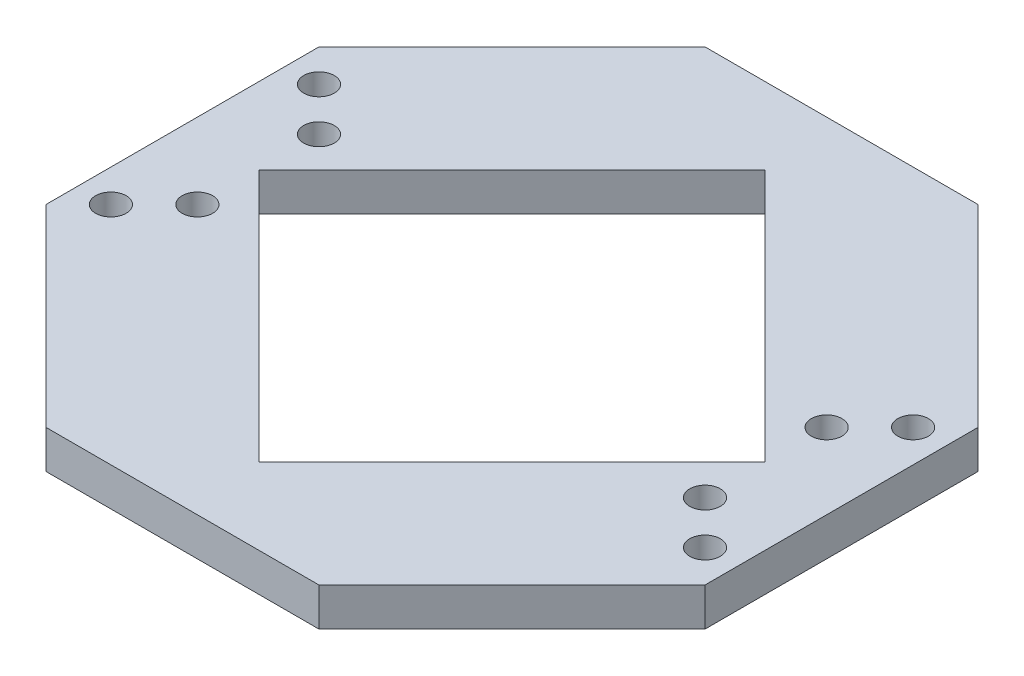
ISO-10303-21;
HEADER;
FILE_DESCRIPTION(('STEP AP214'),'2;1');
FILE_NAME('part.step','',(''),(''),'','','');
FILE_SCHEMA(('AUTOMOTIVE_DESIGN { 1 0 10303 214 1 1 1 1 }'));
ENDSEC;
DATA;
#1=APPLICATION_CONTEXT('core data for automotive mechanical design processes');
#2=APPLICATION_PROTOCOL_DEFINITION('international standard','automotive_design',2000,#1);
#3=PRODUCT_CONTEXT('',#1,'mechanical');
#4=PRODUCT('Part','Part','',(#3));
#5=PRODUCT_RELATED_PRODUCT_CATEGORY('part','',(#4));
#6=PRODUCT_DEFINITION_FORMATION('','',#4);
#7=PRODUCT_DEFINITION_CONTEXT('part definition',#1,'design');
#8=PRODUCT_DEFINITION('design','',#6,#7);
#9=PRODUCT_DEFINITION_SHAPE('','',#8);
#10=(LENGTH_UNIT() NAMED_UNIT(*) SI_UNIT(.MILLI.,.METRE.));
#11=(NAMED_UNIT(*) PLANE_ANGLE_UNIT() SI_UNIT($,.RADIAN.));
#12=(NAMED_UNIT(*) SI_UNIT($,.STERADIAN.) SOLID_ANGLE_UNIT());
#13=UNCERTAINTY_MEASURE_WITH_UNIT(LENGTH_MEASURE(1.E-05),#10,'distance_accuracy_value','');
#14=(GEOMETRIC_REPRESENTATION_CONTEXT(3) GLOBAL_UNCERTAINTY_ASSIGNED_CONTEXT((#13)) GLOBAL_UNIT_ASSIGNED_CONTEXT((#10,
#11,#12)) REPRESENTATION_CONTEXT('',''));
#15=CARTESIAN_POINT('',(0.,0.,0.));
#16=DIRECTION('',(0.,0.,1.));
#17=DIRECTION('',(1.,0.,0.));
#18=AXIS2_PLACEMENT_3D('',#15,#16,#17);
#19=CARTESIAN_POINT('',(38.7054579625169,6.35,-38.7054579625174));
#20=DIRECTION('',(-0.707106781186542,0.,0.707106781186553));
#21=DIRECTION('',(0.707106781186553,0.,0.707106781186542));
#22=AXIS2_PLACEMENT_3D('',#19,#20,#21);
#23=PLANE('',#22);
#24=DIRECTION('',(-0.707106781186553,0.,-0.707106781186542));
#25=VECTOR('',#24,1.);
#26=CARTESIAN_POINT('',(38.7054579625169,0.,-38.7054579625174));
#27=LINE('',#26,#25);
#28=CARTESIAN_POINT('',(54.7377835884533,0.,-22.6731323365812));
#29=VERTEX_POINT('',#28);
#30=CARTESIAN_POINT('',(22.6731323365804,0.,-54.7377835884536));
#31=VERTEX_POINT('',#30);
#32=EDGE_CURVE('E172',#29,#31,#27,.T.);
#33=ORIENTED_EDGE('',*,*,#32,.T.);
#34=DIRECTION('',(0.,-1.,0.));
#35=VECTOR('',#34,1.);
#36=CARTESIAN_POINT('',(22.6731323365804,6.35,-54.7377835884536));
#37=LINE('',#36,#35);
#38=CARTESIAN_POINT('',(22.6731323365804,6.35,-54.7377835884536));
#39=VERTEX_POINT('',#38);
#40=EDGE_CURVE('E11',#39,#31,#37,.T.);
#41=ORIENTED_EDGE('',*,*,#40,.F.);
#42=DIRECTION('',(-0.707106781186553,0.,-0.707106781186542));
#43=VECTOR('',#42,1.);
#44=CARTESIAN_POINT('',(38.7054579625169,6.35,-38.7054579625174));
#45=LINE('',#44,#43);
#46=CARTESIAN_POINT('',(54.7377835884533,6.35,-22.6731323365812));
#47=VERTEX_POINT('',#46);
#48=EDGE_CURVE('E225',#47,#39,#45,.T.);
#49=ORIENTED_EDGE('',*,*,#48,.F.);
#50=DIRECTION('',(0.,-1.,0.));
#51=VECTOR('',#50,1.);
#52=CARTESIAN_POINT('',(54.7377835884533,6.35,-22.6731323365812));
#53=LINE('',#52,#51);
#54=EDGE_CURVE('E187',#47,#29,#53,.T.);
#55=ORIENTED_EDGE('',*,*,#54,.T.);
#56=EDGE_LOOP('',(#33,#41,#49,#55));
#57=FACE_BOUND('',#56,.T.);
#58=ADVANCED_FACE('F35',(#57),#23,.F.);
#59=CARTESIAN_POINT('',(-4.18799294267021E-13,6.35,-54.7377835884535));
#60=DIRECTION('',(0.,0.,1.));
#61=DIRECTION('',(1.,0.,0.));
#62=AXIS2_PLACEMENT_3D('',#59,#60,#61);
#63=PLANE('',#62);
#64=DIRECTION('',(-1.,0.,0.));
#65=VECTOR('',#64,1.);
#66=CARTESIAN_POINT('',(-4.18799294267021E-13,0.,-54.7377835884535));
#67=LINE('',#66,#65);
#68=CARTESIAN_POINT('',(-22.6731323365813,0.,-54.7377835884533));
#69=VERTEX_POINT('',#68);
#70=EDGE_CURVE('E175',#31,#69,#67,.T.);
#71=ORIENTED_EDGE('',*,*,#70,.T.);
#72=DIRECTION('',(0.,-1.,0.));
#73=VECTOR('',#72,1.);
#74=CARTESIAN_POINT('',(-22.6731323365813,6.35,-54.7377835884533));
#75=LINE('',#74,#73);
#76=CARTESIAN_POINT('',(-22.6731323365813,6.35,-54.7377835884533));
#77=VERTEX_POINT('',#76);
#78=EDGE_CURVE('E45',#77,#69,#75,.T.);
#79=ORIENTED_EDGE('',*,*,#78,.F.);
#80=DIRECTION('',(-1.,0.,0.));
#81=VECTOR('',#80,1.);
#82=CARTESIAN_POINT('',(-4.18799294267021E-13,6.35,-54.7377835884535));
#83=LINE('',#82,#81);
#84=EDGE_CURVE('E227',#39,#77,#83,.T.);
#85=ORIENTED_EDGE('',*,*,#84,.F.);
#86=ORIENTED_EDGE('',*,*,#40,.T.);
#87=EDGE_LOOP('',(#71,#79,#85,#86));
#88=FACE_BOUND('',#87,.T.);
#89=ADVANCED_FACE('F263',(#88),#63,.F.);
#90=CARTESIAN_POINT('',(-38.7054579625174,6.35,-38.7054579625169));
#91=DIRECTION('',(0.707106781186553,0.,0.707106781186542));
#92=DIRECTION('',(0.707106781186542,0.,-0.707106781186553));
#93=AXIS2_PLACEMENT_3D('',#90,#91,#92);
#94=PLANE('',#93);
#95=DIRECTION('',(-0.707106781186542,0.,0.707106781186553));
#96=VECTOR('',#95,1.);
#97=CARTESIAN_POINT('',(-38.7054579625174,0.,-38.7054579625169));
#98=LINE('',#97,#96);
#99=CARTESIAN_POINT('',(-54.7377835884536,0.,-22.6731323365804));
#100=VERTEX_POINT('',#99);
#101=EDGE_CURVE('E177',#69,#100,#98,.T.);
#102=ORIENTED_EDGE('',*,*,#101,.T.);
#103=DIRECTION('',(0.,-1.,0.));
#104=VECTOR('',#103,1.);
#105=CARTESIAN_POINT('',(-54.7377835884536,6.35,-22.6731323365804));
#106=LINE('',#105,#104);
#107=CARTESIAN_POINT('',(-54.7377835884536,6.35,-22.6731323365804));
#108=VERTEX_POINT('',#107);
#109=EDGE_CURVE('E194',#108,#100,#106,.T.);
#110=ORIENTED_EDGE('',*,*,#109,.F.);
#111=DIRECTION('',(-0.707106781186542,0.,0.707106781186553));
#112=VECTOR('',#111,1.);
#113=CARTESIAN_POINT('',(-38.7054579625174,6.35,-38.7054579625169));
#114=LINE('',#113,#112);
#115=EDGE_CURVE('E232',#77,#108,#114,.T.);
#116=ORIENTED_EDGE('',*,*,#115,.F.);
#117=ORIENTED_EDGE('',*,*,#78,.T.);
#118=EDGE_LOOP('',(#102,#110,#116,#117));
#119=FACE_BOUND('',#118,.T.);
#120=ADVANCED_FACE('F268',(#119),#94,.F.);
#121=CARTESIAN_POINT('',(-54.7377835884535,6.35,4.1042330838168E-13));
#122=DIRECTION('',(1.,0.,0.));
#123=DIRECTION('',(0.,0.,-1.));
#124=AXIS2_PLACEMENT_3D('',#121,#122,#123);
#125=PLANE('',#124);
#126=DIRECTION('',(0.,0.,1.));
#127=VECTOR('',#126,1.);
#128=CARTESIAN_POINT('',(-54.7377835884535,0.,4.1042330838168E-13));
#129=LINE('',#128,#127);
#130=CARTESIAN_POINT('',(-54.7377835884533,0.,22.6731323365813));
#131=VERTEX_POINT('',#130);
#132=EDGE_CURVE('E179',#100,#131,#129,.T.);
#133=ORIENTED_EDGE('',*,*,#132,.T.);
#134=DIRECTION('',(0.,-1.,0.));
#135=VECTOR('',#134,1.);
#136=CARTESIAN_POINT('',(-54.7377835884533,6.35,22.6731323365813));
#137=LINE('',#136,#135);
#138=CARTESIAN_POINT('',(-54.7377835884533,6.35,22.6731323365813));
#139=VERTEX_POINT('',#138);
#140=EDGE_CURVE('E191',#139,#131,#137,.T.);
#141=ORIENTED_EDGE('',*,*,#140,.F.);
#142=DIRECTION('',(0.,0.,1.));
#143=VECTOR('',#142,1.);
#144=CARTESIAN_POINT('',(-54.7377835884535,6.35,4.1042330838168E-13));
#145=LINE('',#144,#143);
#146=EDGE_CURVE('E234',#108,#139,#145,.T.);
#147=ORIENTED_EDGE('',*,*,#146,.F.);
#148=ORIENTED_EDGE('',*,*,#109,.T.);
#149=EDGE_LOOP('',(#133,#141,#147,#148));
#150=FACE_BOUND('',#149,.T.);
#151=ADVANCED_FACE('F240',(#150),#125,.F.);
#152=CARTESIAN_POINT('',(-38.7054579625169,6.35,38.7054579625175));
#153=DIRECTION('',(0.707106781186542,0.,-0.707106781186553));
#154=DIRECTION('',(-0.707106781186553,0.,-0.707106781186542));
#155=AXIS2_PLACEMENT_3D('',#152,#153,#154);
#156=PLANE('',#155);
#157=DIRECTION('',(0.707106781186553,0.,0.707106781186542));
#158=VECTOR('',#157,1.);
#159=CARTESIAN_POINT('',(-38.7054579625169,0.,38.7054579625175));
#160=LINE('',#159,#158);
#161=CARTESIAN_POINT('',(-22.6731323365805,0.,54.7377835884536));
#162=VERTEX_POINT('',#161);
#163=EDGE_CURVE('E181',#131,#162,#160,.T.);
#164=ORIENTED_EDGE('',*,*,#163,.T.);
#165=DIRECTION('',(0.,-1.,0.));
#166=VECTOR('',#165,1.);
#167=CARTESIAN_POINT('',(-22.6731323365805,6.35,54.7377835884536));
#168=LINE('',#167,#166);
#169=CARTESIAN_POINT('',(-22.6731323365805,6.35,54.7377835884536));
#170=VERTEX_POINT('',#169);
#171=EDGE_CURVE('E150',#170,#162,#168,.T.);
#172=ORIENTED_EDGE('',*,*,#171,.F.);
#173=DIRECTION('',(0.707106781186553,0.,0.707106781186542));
#174=VECTOR('',#173,1.);
#175=CARTESIAN_POINT('',(-38.7054579625169,6.35,38.7054579625175));
#176=LINE('',#175,#174);
#177=EDGE_CURVE('E141',#139,#170,#176,.T.);
#178=ORIENTED_EDGE('',*,*,#177,.F.);
#179=ORIENTED_EDGE('',*,*,#140,.T.);
#180=EDGE_LOOP('',(#164,#172,#178,#179));
#181=FACE_BOUND('',#180,.T.);
#182=ADVANCED_FACE('F244',(#181),#156,.F.);
#183=CARTESIAN_POINT('',(4.0204732249634E-13,6.35,54.7377835884535));
#184=DIRECTION('',(0.,0.,-1.));
#185=DIRECTION('',(-1.,0.,0.));
#186=AXIS2_PLACEMENT_3D('',#183,#184,#185);
#187=PLANE('',#186);
#188=DIRECTION('',(1.,0.,0.));
#189=VECTOR('',#188,1.);
#190=CARTESIAN_POINT('',(4.0204732249634E-13,0.,54.7377835884535));
#191=LINE('',#190,#189);
#192=CARTESIAN_POINT('',(22.6731323365813,0.,54.7377835884533));
#193=VERTEX_POINT('',#192);
#194=EDGE_CURVE('E149',#162,#193,#191,.T.);
#195=ORIENTED_EDGE('',*,*,#194,.T.);
#196=DIRECTION('',(0.,-1.,0.));
#197=VECTOR('',#196,1.);
#198=CARTESIAN_POINT('',(22.6731323365813,6.35,54.7377835884533));
#199=LINE('',#198,#197);
#200=CARTESIAN_POINT('',(22.6731323365813,6.35,54.7377835884533));
#201=VERTEX_POINT('',#200);
#202=EDGE_CURVE('E146',#201,#193,#199,.T.);
#203=ORIENTED_EDGE('',*,*,#202,.F.);
#204=DIRECTION('',(1.,0.,0.));
#205=VECTOR('',#204,1.);
#206=CARTESIAN_POINT('',(4.0204732249634E-13,6.35,54.7377835884535));
#207=LINE('',#206,#205);
#208=EDGE_CURVE('E135',#170,#201,#207,.T.);
#209=ORIENTED_EDGE('',*,*,#208,.F.);
#210=ORIENTED_EDGE('',*,*,#171,.T.);
#211=EDGE_LOOP('',(#195,#203,#209,#210));
#212=FACE_BOUND('',#211,.T.);
#213=ADVANCED_FACE('F147',(#212),#187,.F.);
#214=CARTESIAN_POINT('',(38.7054579625174,6.35,38.7054579625169));
#215=DIRECTION('',(-0.707106781186553,0.,-0.707106781186542));
#216=DIRECTION('',(-0.707106781186542,0.,0.707106781186553));
#217=AXIS2_PLACEMENT_3D('',#214,#215,#216);
#218=PLANE('',#217);
#219=DIRECTION('',(0.707106781186542,0.,-0.707106781186553));
#220=VECTOR('',#219,1.);
#221=CARTESIAN_POINT('',(38.7054579625174,0.,38.7054579625169));
#222=LINE('',#221,#220);
#223=CARTESIAN_POINT('',(54.7377835884536,0.,22.6731323365804));
#224=VERTEX_POINT('',#223);
#225=EDGE_CURVE('E95',#193,#224,#222,.T.);
#226=ORIENTED_EDGE('',*,*,#225,.T.);
#227=DIRECTION('',(0.,-1.,0.));
#228=VECTOR('',#227,1.);
#229=CARTESIAN_POINT('',(54.7377835884536,6.35,22.6731323365804));
#230=LINE('',#229,#228);
#231=CARTESIAN_POINT('',(54.7377835884536,6.35,22.6731323365804));
#232=VERTEX_POINT('',#231);
#233=EDGE_CURVE('E151',#232,#224,#230,.T.);
#234=ORIENTED_EDGE('',*,*,#233,.F.);
#235=DIRECTION('',(0.707106781186542,0.,-0.707106781186553));
#236=VECTOR('',#235,1.);
#237=CARTESIAN_POINT('',(38.7054579625174,6.35,38.7054579625169));
#238=LINE('',#237,#236);
#239=EDGE_CURVE('E139',#201,#232,#238,.T.);
#240=ORIENTED_EDGE('',*,*,#239,.F.);
#241=ORIENTED_EDGE('',*,*,#202,.T.);
#242=EDGE_LOOP('',(#226,#234,#240,#241));
#243=FACE_BOUND('',#242,.T.);
#244=ADVANCED_FACE('F153',(#243),#218,.F.);
#245=CARTESIAN_POINT('',(-21.0188917942268,6.35,-21.0188917942268));
#246=DIRECTION('',(0.707106781186548,0.,0.707106781186547));
#247=DIRECTION('',(0.707106781186547,0.,-0.707106781186548));
#248=AXIS2_PLACEMENT_3D('',#245,#246,#247);
#249=PLANE('',#248);
#250=DIRECTION('',(-0.707106781186547,0.,0.707106781186548));
#251=VECTOR('',#250,1.);
#252=CARTESIAN_POINT('',(-21.0188917942268,0.,-21.0188917942268));
#253=LINE('',#252,#251);
#254=CARTESIAN_POINT('',(0.,0.,-42.0377835884536));
#255=VERTEX_POINT('',#254);
#256=CARTESIAN_POINT('',(-42.0377835884535,0.,0.));
#257=VERTEX_POINT('',#256);
#258=EDGE_CURVE('E159',#255,#257,#253,.T.);
#259=ORIENTED_EDGE('',*,*,#258,.F.);
#260=DIRECTION('',(0.,-1.,0.));
#261=VECTOR('',#260,1.);
#262=CARTESIAN_POINT('',(0.,6.35,-42.0377835884536));
#263=LINE('',#262,#261);
#264=CARTESIAN_POINT('',(0.,6.35,-42.0377835884536));
#265=VERTEX_POINT('',#264);
#266=EDGE_CURVE('E39',#265,#255,#263,.T.);
#267=ORIENTED_EDGE('',*,*,#266,.F.);
#268=DIRECTION('',(-0.707106781186547,0.,0.707106781186548));
#269=VECTOR('',#268,1.);
#270=CARTESIAN_POINT('',(-21.0188917942268,6.35,-21.0188917942268));
#271=LINE('',#270,#269);
#272=CARTESIAN_POINT('',(-42.0377835884535,6.35,0.));
#273=VERTEX_POINT('',#272);
#274=EDGE_CURVE('E186',#265,#273,#271,.T.);
#275=ORIENTED_EDGE('',*,*,#274,.T.);
#276=DIRECTION('',(0.,-1.,0.));
#277=VECTOR('',#276,1.);
#278=CARTESIAN_POINT('',(-42.0377835884535,6.35,0.));
#279=LINE('',#278,#277);
#280=EDGE_CURVE('E155',#273,#257,#279,.T.);
#281=ORIENTED_EDGE('',*,*,#280,.T.);
#282=EDGE_LOOP('',(#259,#267,#275,#281));
#283=FACE_BOUND('',#282,.T.);
#284=ADVANCED_FACE('F37',(#283),#249,.T.);
#285=CARTESIAN_POINT('',(21.0188917942268,6.35,-21.0188917942268));
#286=DIRECTION('',(-0.707106781186549,0.,0.707106781186546));
#287=DIRECTION('',(0.707106781186546,0.,0.707106781186549));
#288=AXIS2_PLACEMENT_3D('',#285,#286,#287);
#289=PLANE('',#288);
#290=DIRECTION('',(-0.707106781186546,0.,-0.707106781186549));
#291=VECTOR('',#290,1.);
#292=CARTESIAN_POINT('',(21.0188917942268,0.,-21.0188917942268));
#293=LINE('',#292,#291);
#294=CARTESIAN_POINT('',(42.0377835884535,0.,0.));
#295=VERTEX_POINT('',#294);
#296=EDGE_CURVE('E162',#295,#255,#293,.T.);
#297=ORIENTED_EDGE('',*,*,#296,.F.);
#298=DIRECTION('',(0.,-1.,0.));
#299=VECTOR('',#298,1.);
#300=CARTESIAN_POINT('',(42.0377835884535,6.35,0.));
#301=LINE('',#300,#299);
#302=CARTESIAN_POINT('',(42.0377835884535,6.35,0.));
#303=VERTEX_POINT('',#302);
#304=EDGE_CURVE('E201',#303,#295,#301,.T.);
#305=ORIENTED_EDGE('',*,*,#304,.F.);
#306=DIRECTION('',(-0.707106781186546,0.,-0.707106781186549));
#307=VECTOR('',#306,1.);
#308=CARTESIAN_POINT('',(21.0188917942268,6.35,-21.0188917942268));
#309=LINE('',#308,#307);
#310=EDGE_CURVE('E210',#303,#265,#309,.T.);
#311=ORIENTED_EDGE('',*,*,#310,.T.);
#312=ORIENTED_EDGE('',*,*,#266,.T.);
#313=EDGE_LOOP('',(#297,#305,#311,#312));
#314=FACE_BOUND('',#313,.T.);
#315=ADVANCED_FACE('F208',(#314),#289,.T.);
#316=CARTESIAN_POINT('',(21.0188917942268,6.35,21.0188917942268));
#317=DIRECTION('',(-0.707106781186548,0.,-0.707106781186547));
#318=DIRECTION('',(-0.707106781186547,0.,0.707106781186548));
#319=AXIS2_PLACEMENT_3D('',#316,#317,#318);
#320=PLANE('',#319);
#321=DIRECTION('',(0.707106781186547,0.,-0.707106781186548));
#322=VECTOR('',#321,1.);
#323=CARTESIAN_POINT('',(21.0188917942268,0.,21.0188917942268));
#324=LINE('',#323,#322);
#325=CARTESIAN_POINT('',(0.,0.,42.0377835884535));
#326=VERTEX_POINT('',#325);
#327=EDGE_CURVE('E166',#326,#295,#324,.T.);
#328=ORIENTED_EDGE('',*,*,#327,.F.);
#329=DIRECTION('',(0.,-1.,0.));
#330=VECTOR('',#329,1.);
#331=CARTESIAN_POINT('',(0.,6.35,42.0377835884535));
#332=LINE('',#331,#330);
#333=CARTESIAN_POINT('',(0.,6.35,42.0377835884535));
#334=VERTEX_POINT('',#333);
#335=EDGE_CURVE('E200',#334,#326,#332,.T.);
#336=ORIENTED_EDGE('',*,*,#335,.F.);
#337=DIRECTION('',(0.707106781186547,0.,-0.707106781186548));
#338=VECTOR('',#337,1.);
#339=CARTESIAN_POINT('',(21.0188917942268,6.35,21.0188917942268));
#340=LINE('',#339,#338);
#341=EDGE_CURVE('E217',#334,#303,#340,.T.);
#342=ORIENTED_EDGE('',*,*,#341,.T.);
#343=ORIENTED_EDGE('',*,*,#304,.T.);
#344=EDGE_LOOP('',(#328,#336,#342,#343));
#345=FACE_BOUND('',#344,.T.);
#346=ADVANCED_FACE('F215',(#345),#320,.T.);
#347=CARTESIAN_POINT('',(-21.0188917942268,6.35,21.0188917942268));
#348=DIRECTION('',(0.707106781186547,0.,-0.707106781186548));
#349=DIRECTION('',(-0.707106781186548,0.,-0.707106781186547));
#350=AXIS2_PLACEMENT_3D('',#347,#348,#349);
#351=PLANE('',#350);
#352=DIRECTION('',(0.707106781186548,0.,0.707106781186547));
#353=VECTOR('',#352,1.);
#354=CARTESIAN_POINT('',(-21.0188917942268,0.,21.0188917942268));
#355=LINE('',#354,#353);
#356=EDGE_CURVE('E169',#257,#326,#355,.T.);
#357=ORIENTED_EDGE('',*,*,#356,.F.);
#358=ORIENTED_EDGE('',*,*,#280,.F.);
#359=DIRECTION('',(0.707106781186548,0.,0.707106781186547));
#360=VECTOR('',#359,1.);
#361=CARTESIAN_POINT('',(-21.0188917942268,6.35,21.0188917942268));
#362=LINE('',#361,#360);
#363=EDGE_CURVE('E222',#273,#334,#362,.T.);
#364=ORIENTED_EDGE('',*,*,#363,.T.);
#365=ORIENTED_EDGE('',*,*,#335,.T.);
#366=EDGE_LOOP('',(#357,#358,#364,#365));
#367=FACE_BOUND('',#366,.T.);
#368=ADVANCED_FACE('F224',(#367),#351,.T.);
#369=CARTESIAN_POINT('',(54.7377835884535,6.35,-4.0204732249634E-13));
#370=DIRECTION('',(-1.,0.,0.));
#371=DIRECTION('',(0.,0.,1.));
#372=AXIS2_PLACEMENT_3D('',#369,#370,#371);
#373=PLANE('',#372);
#374=DIRECTION('',(0.,0.,-1.));
#375=VECTOR('',#374,1.);
#376=CARTESIAN_POINT('',(54.7377835884535,0.,-4.0204732249634E-13));
#377=LINE('',#376,#375);
#378=EDGE_CURVE('E101',#224,#29,#377,.T.);
#379=ORIENTED_EDGE('',*,*,#378,.T.);
#380=ORIENTED_EDGE('',*,*,#54,.F.);
#381=DIRECTION('',(0.,0.,-1.));
#382=VECTOR('',#381,1.);
#383=CARTESIAN_POINT('',(54.7377835884535,6.35,-4.0204732249634E-13));
#384=LINE('',#383,#382);
#385=EDGE_CURVE('E54',#232,#47,#384,.T.);
#386=ORIENTED_EDGE('',*,*,#385,.F.);
#387=ORIENTED_EDGE('',*,*,#233,.T.);
#388=EDGE_LOOP('',(#379,#380,#386,#387));
#389=FACE_BOUND('',#388,.T.);
#390=ADVANCED_FACE('F250',(#389),#373,.F.);
#391=CARTESIAN_POINT('',(0.,6.35,0.));
#392=DIRECTION('',(0.,1.,0.));
#393=DIRECTION('',(0.,0.,1.));
#394=AXIS2_PLACEMENT_3D('',#391,#392,#393);
#395=PLANE('',#394);
#396=CARTESIAN_POINT('',(42.1654250189557,6.35,-10.1007737670836));
#397=DIRECTION('',(0.,1.,0.));
#398=DIRECTION('',(0.,0.,1.));
#399=AXIS2_PLACEMENT_3D('',#396,#397,#398);
#400=CIRCLE('',#399,2.54);
#401=CARTESIAN_POINT('',(42.1654250189557,6.35,-7.56077376708361));
#402=VERTEX_POINT('',#401);
#403=EDGE_CURVE('E444',#402,#402,#400,.T.);
#404=ORIENTED_EDGE('',*,*,#403,.F.);
#405=EDGE_LOOP('',(#404));
#406=FACE_BOUND('',#405,.T.);
#407=CARTESIAN_POINT('',(49.3496299158121,6.35,17.284978663939));
#408=DIRECTION('',(0.,1.,0.));
#409=DIRECTION('',(0.,0.,1.));
#410=AXIS2_PLACEMENT_3D('',#407,#408,#409);
#411=CIRCLE('',#410,2.54);
#412=CARTESIAN_POINT('',(49.3496299158121,6.35,19.824978663939));
#413=VERTEX_POINT('',#412);
#414=EDGE_CURVE('E446',#413,#413,#411,.T.);
#415=ORIENTED_EDGE('',*,*,#414,.F.);
#416=EDGE_LOOP('',(#415));
#417=FACE_BOUND('',#416,.T.);
#418=CARTESIAN_POINT('',(49.3496299158118,6.35,-17.2849786639398));
#419=DIRECTION('',(0.,1.,0.));
#420=DIRECTION('',(0.,0.,1.));
#421=AXIS2_PLACEMENT_3D('',#418,#419,#420);
#422=CIRCLE('',#421,2.54);
#423=CARTESIAN_POINT('',(49.3496299158118,6.35,-14.7449786639398));
#424=VERTEX_POINT('',#423);
#425=EDGE_CURVE('E452',#424,#424,#422,.T.);
#426=ORIENTED_EDGE('',*,*,#425,.F.);
#427=EDGE_LOOP('',(#426));
#428=FACE_BOUND('',#427,.T.);
#429=CARTESIAN_POINT('',(42.1654250189557,6.35,10.1007737670826));
#430=DIRECTION('',(0.,1.,0.));
#431=DIRECTION('',(0.,0.,1.));
#432=AXIS2_PLACEMENT_3D('',#429,#430,#431);
#433=CIRCLE('',#432,2.54);
#434=CARTESIAN_POINT('',(42.1654250189557,6.35,12.6407737670826));
#435=VERTEX_POINT('',#434);
#436=EDGE_CURVE('E458',#435,#435,#433,.T.);
#437=ORIENTED_EDGE('',*,*,#436,.F.);
#438=EDGE_LOOP('',(#437));
#439=FACE_BOUND('',#438,.T.);
#440=CARTESIAN_POINT('',(-42.1654250189568,6.35,10.1007737670848));
#441=DIRECTION('',(0.,1.,0.));
#442=DIRECTION('',(0.,0.,1.));
#443=AXIS2_PLACEMENT_3D('',#440,#441,#442);
#444=CIRCLE('',#443,2.54);
#445=CARTESIAN_POINT('',(-42.1654250189568,6.35,12.6407737670848));
#446=VERTEX_POINT('',#445);
#447=EDGE_CURVE('E464',#446,#446,#444,.T.);
#448=ORIENTED_EDGE('',*,*,#447,.F.);
#449=EDGE_LOOP('',(#448));
#450=FACE_BOUND('',#449,.T.);
#451=CARTESIAN_POINT('',(-49.3496299158118,6.35,17.2849786639398));
#452=DIRECTION('',(0.,1.,0.));
#453=DIRECTION('',(0.,0.,1.));
#454=AXIS2_PLACEMENT_3D('',#451,#452,#453);
#455=CIRCLE('',#454,2.54);
#456=CARTESIAN_POINT('',(-49.3496299158118,6.35,19.8249786639398));
#457=VERTEX_POINT('',#456);
#458=EDGE_CURVE('E470',#457,#457,#455,.T.);
#459=ORIENTED_EDGE('',*,*,#458,.F.);
#460=EDGE_LOOP('',(#459));
#461=FACE_BOUND('',#460,.T.);
#462=CARTESIAN_POINT('',(-42.1654250189568,6.35,-10.1007737670836));
#463=DIRECTION('',(0.,1.,0.));
#464=DIRECTION('',(0.,0.,1.));
#465=AXIS2_PLACEMENT_3D('',#462,#463,#464);
#466=CIRCLE('',#465,2.54);
#467=CARTESIAN_POINT('',(-42.1654250189568,6.35,-7.56077376708361));
#468=VERTEX_POINT('',#467);
#469=EDGE_CURVE('E476',#468,#468,#466,.T.);
#470=ORIENTED_EDGE('',*,*,#469,.F.);
#471=EDGE_LOOP('',(#470));
#472=FACE_BOUND('',#471,.T.);
#473=CARTESIAN_POINT('',(-49.3496299158121,6.35,-17.2849786639389));
#474=DIRECTION('',(0.,1.,0.));
#475=DIRECTION('',(0.,0.,1.));
#476=AXIS2_PLACEMENT_3D('',#473,#474,#475);
#477=CIRCLE('',#476,2.54);
#478=CARTESIAN_POINT('',(-49.3496299158121,6.35,-14.7449786639389));
#479=VERTEX_POINT('',#478);
#480=EDGE_CURVE('E482',#479,#479,#477,.T.);
#481=ORIENTED_EDGE('',*,*,#480,.F.);
#482=EDGE_LOOP('',(#481));
#483=FACE_BOUND('',#482,.T.);
#484=ORIENTED_EDGE('',*,*,#274,.F.);
#485=ORIENTED_EDGE('',*,*,#310,.F.);
#486=ORIENTED_EDGE('',*,*,#341,.F.);
#487=ORIENTED_EDGE('',*,*,#363,.F.);
#488=EDGE_LOOP('',(#484,#485,#486,#487));
#489=FACE_BOUND('',#488,.T.);
#490=ORIENTED_EDGE('',*,*,#48,.T.);
#491=ORIENTED_EDGE('',*,*,#84,.T.);
#492=ORIENTED_EDGE('',*,*,#115,.T.);
#493=ORIENTED_EDGE('',*,*,#146,.T.);
#494=ORIENTED_EDGE('',*,*,#177,.T.);
#495=ORIENTED_EDGE('',*,*,#208,.T.);
#496=ORIENTED_EDGE('',*,*,#239,.T.);
#497=ORIENTED_EDGE('',*,*,#385,.T.);
#498=EDGE_LOOP('',(#490,#491,#492,#493,#494,#495,#496,#497));
#499=FACE_BOUND('',#498,.T.);
#500=ADVANCED_FACE('F137',(#406,#417,#428,#439,#450,#461,#472,#483,#489,#499),#395,.T.);
#501=CARTESIAN_POINT('',(0.,0.,0.));
#502=DIRECTION('',(0.,1.,0.));
#503=DIRECTION('',(0.,0.,1.));
#504=AXIS2_PLACEMENT_3D('',#501,#502,#503);
#505=PLANE('',#504);
#506=CARTESIAN_POINT('',(42.1654250189557,0.,-10.1007737670836));
#507=DIRECTION('',(0.,1.,0.));
#508=DIRECTION('',(0.,0.,1.));
#509=AXIS2_PLACEMENT_3D('',#506,#507,#508);
#510=CIRCLE('',#509,2.54);
#511=CARTESIAN_POINT('',(42.1654250189557,0.,-7.56077376708361));
#512=VERTEX_POINT('',#511);
#513=EDGE_CURVE('E441',#512,#512,#510,.T.);
#514=ORIENTED_EDGE('',*,*,#513,.T.);
#515=EDGE_LOOP('',(#514));
#516=FACE_BOUND('',#515,.T.);
#517=CARTESIAN_POINT('',(49.3496299158121,0.,17.284978663939));
#518=DIRECTION('',(0.,1.,0.));
#519=DIRECTION('',(0.,0.,1.));
#520=AXIS2_PLACEMENT_3D('',#517,#518,#519);
#521=CIRCLE('',#520,2.54);
#522=CARTESIAN_POINT('',(49.3496299158121,0.,19.824978663939));
#523=VERTEX_POINT('',#522);
#524=EDGE_CURVE('E449',#523,#523,#521,.T.);
#525=ORIENTED_EDGE('',*,*,#524,.T.);
#526=EDGE_LOOP('',(#525));
#527=FACE_BOUND('',#526,.T.);
#528=CARTESIAN_POINT('',(49.3496299158118,0.,-17.2849786639398));
#529=DIRECTION('',(0.,1.,0.));
#530=DIRECTION('',(0.,0.,1.));
#531=AXIS2_PLACEMENT_3D('',#528,#529,#530);
#532=CIRCLE('',#531,2.54);
#533=CARTESIAN_POINT('',(49.3496299158118,0.,-14.7449786639398));
#534=VERTEX_POINT('',#533);
#535=EDGE_CURVE('E455',#534,#534,#532,.T.);
#536=ORIENTED_EDGE('',*,*,#535,.T.);
#537=EDGE_LOOP('',(#536));
#538=FACE_BOUND('',#537,.T.);
#539=CARTESIAN_POINT('',(42.1654250189557,0.,10.1007737670826));
#540=DIRECTION('',(0.,1.,0.));
#541=DIRECTION('',(0.,0.,1.));
#542=AXIS2_PLACEMENT_3D('',#539,#540,#541);
#543=CIRCLE('',#542,2.54);
#544=CARTESIAN_POINT('',(42.1654250189557,0.,12.6407737670826));
#545=VERTEX_POINT('',#544);
#546=EDGE_CURVE('E461',#545,#545,#543,.T.);
#547=ORIENTED_EDGE('',*,*,#546,.T.);
#548=EDGE_LOOP('',(#547));
#549=FACE_BOUND('',#548,.T.);
#550=CARTESIAN_POINT('',(-42.1654250189568,0.,10.1007737670848));
#551=DIRECTION('',(0.,1.,0.));
#552=DIRECTION('',(0.,0.,1.));
#553=AXIS2_PLACEMENT_3D('',#550,#551,#552);
#554=CIRCLE('',#553,2.54);
#555=CARTESIAN_POINT('',(-42.1654250189568,0.,12.6407737670848));
#556=VERTEX_POINT('',#555);
#557=EDGE_CURVE('E467',#556,#556,#554,.T.);
#558=ORIENTED_EDGE('',*,*,#557,.T.);
#559=EDGE_LOOP('',(#558));
#560=FACE_BOUND('',#559,.T.);
#561=CARTESIAN_POINT('',(-49.3496299158118,0.,17.2849786639398));
#562=DIRECTION('',(0.,1.,0.));
#563=DIRECTION('',(0.,0.,1.));
#564=AXIS2_PLACEMENT_3D('',#561,#562,#563);
#565=CIRCLE('',#564,2.54);
#566=CARTESIAN_POINT('',(-49.3496299158118,0.,19.8249786639398));
#567=VERTEX_POINT('',#566);
#568=EDGE_CURVE('E473',#567,#567,#565,.T.);
#569=ORIENTED_EDGE('',*,*,#568,.T.);
#570=EDGE_LOOP('',(#569));
#571=FACE_BOUND('',#570,.T.);
#572=CARTESIAN_POINT('',(-42.1654250189568,0.,-10.1007737670836));
#573=DIRECTION('',(0.,1.,0.));
#574=DIRECTION('',(0.,0.,1.));
#575=AXIS2_PLACEMENT_3D('',#572,#573,#574);
#576=CIRCLE('',#575,2.54);
#577=CARTESIAN_POINT('',(-42.1654250189568,0.,-7.56077376708361));
#578=VERTEX_POINT('',#577);
#579=EDGE_CURVE('E479',#578,#578,#576,.T.);
#580=ORIENTED_EDGE('',*,*,#579,.T.);
#581=EDGE_LOOP('',(#580));
#582=FACE_BOUND('',#581,.T.);
#583=CARTESIAN_POINT('',(-49.3496299158121,0.,-17.2849786639389));
#584=DIRECTION('',(0.,1.,0.));
#585=DIRECTION('',(0.,0.,1.));
#586=AXIS2_PLACEMENT_3D('',#583,#584,#585);
#587=CIRCLE('',#586,2.54);
#588=CARTESIAN_POINT('',(-49.3496299158121,0.,-14.7449786639389));
#589=VERTEX_POINT('',#588);
#590=EDGE_CURVE('E163',#589,#589,#587,.T.);
#591=ORIENTED_EDGE('',*,*,#590,.T.);
#592=EDGE_LOOP('',(#591));
#593=FACE_BOUND('',#592,.T.);
#594=ORIENTED_EDGE('',*,*,#258,.T.);
#595=ORIENTED_EDGE('',*,*,#356,.T.);
#596=ORIENTED_EDGE('',*,*,#327,.T.);
#597=ORIENTED_EDGE('',*,*,#296,.T.);
#598=EDGE_LOOP('',(#594,#595,#596,#597));
#599=FACE_BOUND('',#598,.T.);
#600=ORIENTED_EDGE('',*,*,#32,.F.);
#601=ORIENTED_EDGE('',*,*,#378,.F.);
#602=ORIENTED_EDGE('',*,*,#225,.F.);
#603=ORIENTED_EDGE('',*,*,#194,.F.);
#604=ORIENTED_EDGE('',*,*,#163,.F.);
#605=ORIENTED_EDGE('',*,*,#132,.F.);
#606=ORIENTED_EDGE('',*,*,#101,.F.);
#607=ORIENTED_EDGE('',*,*,#70,.F.);
#608=EDGE_LOOP('',(#600,#601,#602,#603,#604,#605,#606,#607));
#609=FACE_BOUND('',#608,.T.);
#610=ADVANCED_FACE('F213',(#516,#527,#538,#549,#560,#571,#582,#593,#599,#609),#505,.F.);
#611=CARTESIAN_POINT('',(-49.3496299158121,0.,-17.2849786639389));
#612=DIRECTION('',(0.,1.,0.));
#613=DIRECTION('',(0.,0.,1.));
#614=AXIS2_PLACEMENT_3D('',#611,#612,#613);
#615=CYLINDRICAL_SURFACE('',#614,2.54);
#616=ORIENTED_EDGE('',*,*,#590,.F.);
#617=EDGE_LOOP('',(#616));
#618=FACE_BOUND('',#617,.T.);
#619=ORIENTED_EDGE('',*,*,#480,.T.);
#620=EDGE_LOOP('',(#619));
#621=FACE_BOUND('',#620,.T.);
#622=ADVANCED_FACE('F354',(#618,#621),#615,.F.);
#623=CARTESIAN_POINT('',(-42.1654250189568,0.,-10.1007737670836));
#624=DIRECTION('',(0.,1.,0.));
#625=DIRECTION('',(0.,0.,1.));
#626=AXIS2_PLACEMENT_3D('',#623,#624,#625);
#627=CYLINDRICAL_SURFACE('',#626,2.54);
#628=ORIENTED_EDGE('',*,*,#579,.F.);
#629=EDGE_LOOP('',(#628));
#630=FACE_BOUND('',#629,.T.);
#631=ORIENTED_EDGE('',*,*,#469,.T.);
#632=EDGE_LOOP('',(#631));
#633=FACE_BOUND('',#632,.T.);
#634=ADVANCED_FACE('F364',(#630,#633),#627,.F.);
#635=CARTESIAN_POINT('',(-49.3496299158118,0.,17.2849786639398));
#636=DIRECTION('',(0.,1.,0.));
#637=DIRECTION('',(0.,0.,1.));
#638=AXIS2_PLACEMENT_3D('',#635,#636,#637);
#639=CYLINDRICAL_SURFACE('',#638,2.54);
#640=ORIENTED_EDGE('',*,*,#568,.F.);
#641=EDGE_LOOP('',(#640));
#642=FACE_BOUND('',#641,.T.);
#643=ORIENTED_EDGE('',*,*,#458,.T.);
#644=EDGE_LOOP('',(#643));
#645=FACE_BOUND('',#644,.T.);
#646=ADVANCED_FACE('F374',(#642,#645),#639,.F.);
#647=CARTESIAN_POINT('',(-42.1654250189568,0.,10.1007737670848));
#648=DIRECTION('',(0.,1.,0.));
#649=DIRECTION('',(0.,0.,1.));
#650=AXIS2_PLACEMENT_3D('',#647,#648,#649);
#651=CYLINDRICAL_SURFACE('',#650,2.54);
#652=ORIENTED_EDGE('',*,*,#557,.F.);
#653=EDGE_LOOP('',(#652));
#654=FACE_BOUND('',#653,.T.);
#655=ORIENTED_EDGE('',*,*,#447,.T.);
#656=EDGE_LOOP('',(#655));
#657=FACE_BOUND('',#656,.T.);
#658=ADVANCED_FACE('F384',(#654,#657),#651,.F.);
#659=CARTESIAN_POINT('',(42.1654250189557,0.,10.1007737670826));
#660=DIRECTION('',(0.,1.,0.));
#661=DIRECTION('',(0.,0.,1.));
#662=AXIS2_PLACEMENT_3D('',#659,#660,#661);
#663=CYLINDRICAL_SURFACE('',#662,2.54);
#664=ORIENTED_EDGE('',*,*,#546,.F.);
#665=EDGE_LOOP('',(#664));
#666=FACE_BOUND('',#665,.T.);
#667=ORIENTED_EDGE('',*,*,#436,.T.);
#668=EDGE_LOOP('',(#667));
#669=FACE_BOUND('',#668,.T.);
#670=ADVANCED_FACE('F394',(#666,#669),#663,.F.);
#671=CARTESIAN_POINT('',(49.3496299158118,0.,-17.2849786639398));
#672=DIRECTION('',(0.,1.,0.));
#673=DIRECTION('',(0.,0.,1.));
#674=AXIS2_PLACEMENT_3D('',#671,#672,#673);
#675=CYLINDRICAL_SURFACE('',#674,2.54);
#676=ORIENTED_EDGE('',*,*,#535,.F.);
#677=EDGE_LOOP('',(#676));
#678=FACE_BOUND('',#677,.T.);
#679=ORIENTED_EDGE('',*,*,#425,.T.);
#680=EDGE_LOOP('',(#679));
#681=FACE_BOUND('',#680,.T.);
#682=ADVANCED_FACE('F404',(#678,#681),#675,.F.);
#683=CARTESIAN_POINT('',(49.3496299158121,0.,17.284978663939));
#684=DIRECTION('',(0.,1.,0.));
#685=DIRECTION('',(0.,0.,1.));
#686=AXIS2_PLACEMENT_3D('',#683,#684,#685);
#687=CYLINDRICAL_SURFACE('',#686,2.54);
#688=ORIENTED_EDGE('',*,*,#524,.F.);
#689=EDGE_LOOP('',(#688));
#690=FACE_BOUND('',#689,.T.);
#691=ORIENTED_EDGE('',*,*,#414,.T.);
#692=EDGE_LOOP('',(#691));
#693=FACE_BOUND('',#692,.T.);
#694=ADVANCED_FACE('F414',(#690,#693),#687,.F.);
#695=CARTESIAN_POINT('',(42.1654250189557,0.,-10.1007737670836));
#696=DIRECTION('',(0.,1.,0.));
#697=DIRECTION('',(0.,0.,1.));
#698=AXIS2_PLACEMENT_3D('',#695,#696,#697);
#699=CYLINDRICAL_SURFACE('',#698,2.54);
#700=ORIENTED_EDGE('',*,*,#513,.F.);
#701=EDGE_LOOP('',(#700));
#702=FACE_BOUND('',#701,.T.);
#703=ORIENTED_EDGE('',*,*,#403,.T.);
#704=EDGE_LOOP('',(#703));
#705=FACE_BOUND('',#704,.T.);
#706=ADVANCED_FACE('F424',(#702,#705),#699,.F.);
#707=CLOSED_SHELL('',(#58,#89,#120,#151,#182,#213,#244,#284,#315,#346,#368,#390,#500,#610,#622,
#634,#646,#658,#670,#682,#694,#706));
#708=MANIFOLD_SOLID_BREP('B2',#707);
#709=ADVANCED_BREP_SHAPE_REPRESENTATION('',(#18,#708),#14);
#710=SHAPE_DEFINITION_REPRESENTATION(#9,#709);
ENDSEC;
END-ISO-10303-21;
